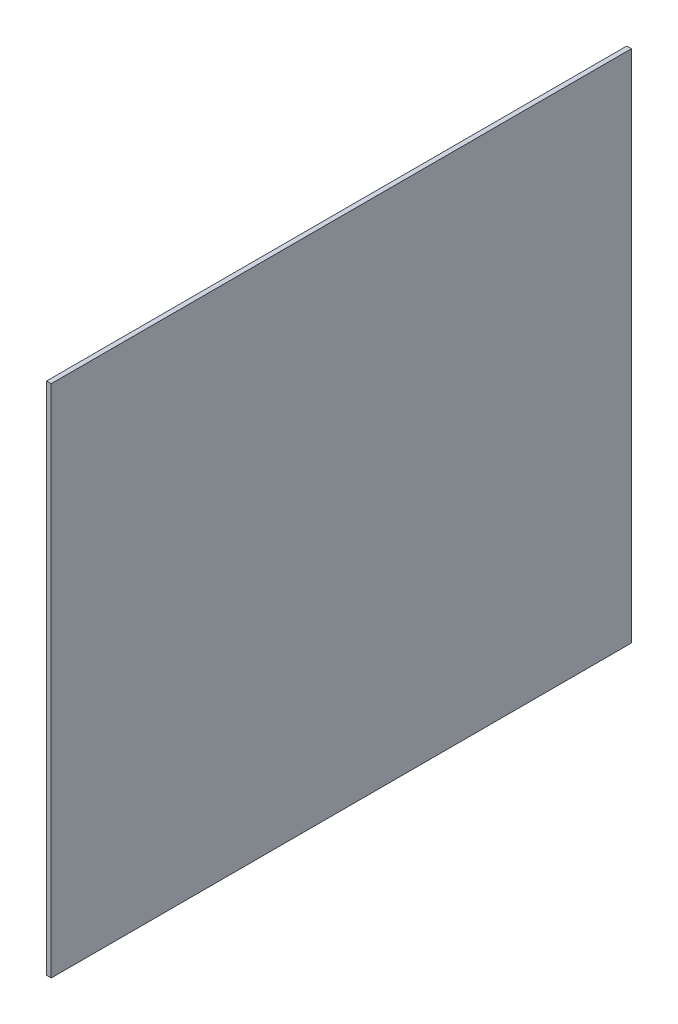
ISO-10303-21;
HEADER;
FILE_DESCRIPTION(('STEP AP214'),'2;1');
FILE_NAME('part.step','',(''),(''),'','','');
FILE_SCHEMA(('AUTOMOTIVE_DESIGN { 1 0 10303 214 1 1 1 1 }'));
ENDSEC;
DATA;
#1=APPLICATION_CONTEXT('core data for automotive mechanical design processes');
#2=APPLICATION_PROTOCOL_DEFINITION('international standard','automotive_design',2000,#1);
#3=PRODUCT_CONTEXT('',#1,'mechanical');
#4=PRODUCT('Part','Part','',(#3));
#5=PRODUCT_RELATED_PRODUCT_CATEGORY('part','',(#4));
#6=PRODUCT_DEFINITION_FORMATION('','',#4);
#7=PRODUCT_DEFINITION_CONTEXT('part definition',#1,'design');
#8=PRODUCT_DEFINITION('design','',#6,#7);
#9=PRODUCT_DEFINITION_SHAPE('','',#8);
#10=(LENGTH_UNIT() NAMED_UNIT(*) SI_UNIT(.MILLI.,.METRE.));
#11=(NAMED_UNIT(*) PLANE_ANGLE_UNIT() SI_UNIT($,.RADIAN.));
#12=(NAMED_UNIT(*) SI_UNIT($,.STERADIAN.) SOLID_ANGLE_UNIT());
#13=UNCERTAINTY_MEASURE_WITH_UNIT(LENGTH_MEASURE(1.E-05),#10,'distance_accuracy_value','');
#14=(GEOMETRIC_REPRESENTATION_CONTEXT(3) GLOBAL_UNCERTAINTY_ASSIGNED_CONTEXT((#13)) GLOBAL_UNIT_ASSIGNED_CONTEXT((#10,
#11,#12)) REPRESENTATION_CONTEXT('',''));
#15=CARTESIAN_POINT('',(0.,0.,0.));
#16=DIRECTION('',(0.,0.,1.));
#17=DIRECTION('',(1.,0.,0.));
#18=AXIS2_PLACEMENT_3D('',#15,#16,#17);
#19=CARTESIAN_POINT('',(0.1,0.,0.));
#20=DIRECTION('',(0.,0.,-1.));
#21=DIRECTION('',(-1.,0.,0.));
#22=AXIS2_PLACEMENT_3D('',#19,#20,#21);
#23=PLANE('',#22);
#24=DIRECTION('',(0.,-1.,0.));
#25=VECTOR('',#24,1.);
#26=CARTESIAN_POINT('',(0.,0.,0.));
#27=LINE('',#26,#25);
#28=CARTESIAN_POINT('',(0.,11.,0.));
#29=VERTEX_POINT('',#28);
#30=CARTESIAN_POINT('',(0.,0.,0.));
#31=VERTEX_POINT('',#30);
#32=EDGE_CURVE('E95',#29,#31,#27,.T.);
#33=ORIENTED_EDGE('',*,*,#32,.T.);
#34=DIRECTION('',(-1.,0.,0.));
#35=VECTOR('',#34,1.);
#36=CARTESIAN_POINT('',(0.1,0.,0.));
#37=LINE('',#36,#35);
#38=CARTESIAN_POINT('',(0.1,0.,0.));
#39=VERTEX_POINT('',#38);
#40=EDGE_CURVE('E11',#39,#31,#37,.T.);
#41=ORIENTED_EDGE('',*,*,#40,.F.);
#42=DIRECTION('',(0.,-1.,0.));
#43=VECTOR('',#42,1.);
#44=CARTESIAN_POINT('',(0.1,0.,0.));
#45=LINE('',#44,#43);
#46=CARTESIAN_POINT('',(0.1,11.,0.));
#47=VERTEX_POINT('',#46);
#48=EDGE_CURVE('E83',#47,#39,#45,.T.);
#49=ORIENTED_EDGE('',*,*,#48,.F.);
#50=DIRECTION('',(-1.,0.,0.));
#51=VECTOR('',#50,1.);
#52=CARTESIAN_POINT('',(0.1,11.,0.));
#53=LINE('',#52,#51);
#54=EDGE_CURVE('E91',#47,#29,#53,.T.);
#55=ORIENTED_EDGE('',*,*,#54,.T.);
#56=EDGE_LOOP('',(#33,#41,#49,#55));
#57=FACE_BOUND('',#56,.T.);
#58=ADVANCED_FACE('F32',(#57),#23,.F.);
#59=CARTESIAN_POINT('',(0.1,0.,0.));
#60=DIRECTION('',(0.,1.,0.));
#61=DIRECTION('',(0.,0.,1.));
#62=AXIS2_PLACEMENT_3D('',#59,#60,#61);
#63=PLANE('',#62);
#64=DIRECTION('',(0.,0.,-1.));
#65=VECTOR('',#64,1.);
#66=CARTESIAN_POINT('',(0.,0.,0.));
#67=LINE('',#66,#65);
#68=CARTESIAN_POINT('',(0.,0.,-12.4));
#69=VERTEX_POINT('',#68);
#70=EDGE_CURVE('E87',#31,#69,#67,.T.);
#71=ORIENTED_EDGE('',*,*,#70,.T.);
#72=DIRECTION('',(-1.,0.,0.));
#73=VECTOR('',#72,1.);
#74=CARTESIAN_POINT('',(0.1,0.,-12.4));
#75=LINE('',#74,#73);
#76=CARTESIAN_POINT('',(0.1,0.,-12.4));
#77=VERTEX_POINT('',#76);
#78=EDGE_CURVE('E40',#77,#69,#75,.T.);
#79=ORIENTED_EDGE('',*,*,#78,.F.);
#80=DIRECTION('',(0.,0.,-1.));
#81=VECTOR('',#80,1.);
#82=CARTESIAN_POINT('',(0.1,0.,0.));
#83=LINE('',#82,#81);
#84=EDGE_CURVE('E78',#39,#77,#83,.T.);
#85=ORIENTED_EDGE('',*,*,#84,.F.);
#86=ORIENTED_EDGE('',*,*,#40,.T.);
#87=EDGE_LOOP('',(#71,#79,#85,#86));
#88=FACE_BOUND('',#87,.T.);
#89=ADVANCED_FACE('F86',(#88),#63,.F.);
#90=CARTESIAN_POINT('',(0.1,0.,-12.4));
#91=DIRECTION('',(0.,0.,1.));
#92=DIRECTION('',(0.,-1.,0.));
#93=AXIS2_PLACEMENT_3D('',#90,#91,#92);
#94=PLANE('',#93);
#95=DIRECTION('',(0.,1.,0.));
#96=VECTOR('',#95,1.);
#97=CARTESIAN_POINT('',(0.,0.,-12.4));
#98=LINE('',#97,#96);
#99=CARTESIAN_POINT('',(0.,11.,-12.4));
#100=VERTEX_POINT('',#99);
#101=EDGE_CURVE('E65',#69,#100,#98,.T.);
#102=ORIENTED_EDGE('',*,*,#101,.T.);
#103=DIRECTION('',(-1.,0.,0.));
#104=VECTOR('',#103,1.);
#105=CARTESIAN_POINT('',(0.1,11.,-12.4));
#106=LINE('',#105,#104);
#107=CARTESIAN_POINT('',(0.1,11.,-12.4));
#108=VERTEX_POINT('',#107);
#109=EDGE_CURVE('E88',#108,#100,#106,.T.);
#110=ORIENTED_EDGE('',*,*,#109,.F.);
#111=DIRECTION('',(0.,1.,0.));
#112=VECTOR('',#111,1.);
#113=CARTESIAN_POINT('',(0.1,0.,-12.4));
#114=LINE('',#113,#112);
#115=EDGE_CURVE('E81',#77,#108,#114,.T.);
#116=ORIENTED_EDGE('',*,*,#115,.F.);
#117=ORIENTED_EDGE('',*,*,#78,.T.);
#118=EDGE_LOOP('',(#102,#110,#116,#117));
#119=FACE_BOUND('',#118,.T.);
#120=ADVANCED_FACE('F89',(#119),#94,.F.);
#121=CARTESIAN_POINT('',(0.1,11.,0.));
#122=DIRECTION('',(0.,-1.,0.));
#123=DIRECTION('',(0.,0.,-1.));
#124=AXIS2_PLACEMENT_3D('',#121,#122,#123);
#125=PLANE('',#124);
#126=DIRECTION('',(0.,0.,1.));
#127=VECTOR('',#126,1.);
#128=CARTESIAN_POINT('',(0.,11.,0.));
#129=LINE('',#128,#127);
#130=EDGE_CURVE('E71',#100,#29,#129,.T.);
#131=ORIENTED_EDGE('',*,*,#130,.T.);
#132=ORIENTED_EDGE('',*,*,#54,.F.);
#133=DIRECTION('',(0.,0.,1.));
#134=VECTOR('',#133,1.);
#135=CARTESIAN_POINT('',(0.1,11.,0.));
#136=LINE('',#135,#134);
#137=EDGE_CURVE('E48',#108,#47,#136,.T.);
#138=ORIENTED_EDGE('',*,*,#137,.F.);
#139=ORIENTED_EDGE('',*,*,#109,.T.);
#140=EDGE_LOOP('',(#131,#132,#138,#139));
#141=FACE_BOUND('',#140,.T.);
#142=ADVANCED_FACE('F102',(#141),#125,.F.);
#143=CARTESIAN_POINT('',(0.1,0.,0.));
#144=DIRECTION('',(-1.,0.,0.));
#145=DIRECTION('',(0.,0.,1.));
#146=AXIS2_PLACEMENT_3D('',#143,#144,#145);
#147=PLANE('',#146);
#148=ORIENTED_EDGE('',*,*,#48,.T.);
#149=ORIENTED_EDGE('',*,*,#84,.T.);
#150=ORIENTED_EDGE('',*,*,#115,.T.);
#151=ORIENTED_EDGE('',*,*,#137,.T.);
#152=EDGE_LOOP('',(#148,#149,#150,#151));
#153=FACE_BOUND('',#152,.T.);
#154=ADVANCED_FACE('F79',(#153),#147,.F.);
#155=CARTESIAN_POINT('',(0.,0.,0.));
#156=DIRECTION('',(-1.,0.,0.));
#157=DIRECTION('',(0.,0.,1.));
#158=AXIS2_PLACEMENT_3D('',#155,#156,#157);
#159=PLANE('',#158);
#160=ORIENTED_EDGE('',*,*,#32,.F.);
#161=ORIENTED_EDGE('',*,*,#130,.F.);
#162=ORIENTED_EDGE('',*,*,#101,.F.);
#163=ORIENTED_EDGE('',*,*,#70,.F.);
#164=EDGE_LOOP('',(#160,#161,#162,#163));
#165=FACE_BOUND('',#164,.T.);
#166=ADVANCED_FACE('F105',(#165),#159,.T.);
#167=CLOSED_SHELL('',(#58,#89,#120,#142,#154,#166));
#168=MANIFOLD_SOLID_BREP('B2',#167);
#169=ADVANCED_BREP_SHAPE_REPRESENTATION('',(#18,#168),#14);
#170=SHAPE_DEFINITION_REPRESENTATION(#9,#169);
ENDSEC;
END-ISO-10303-21;
